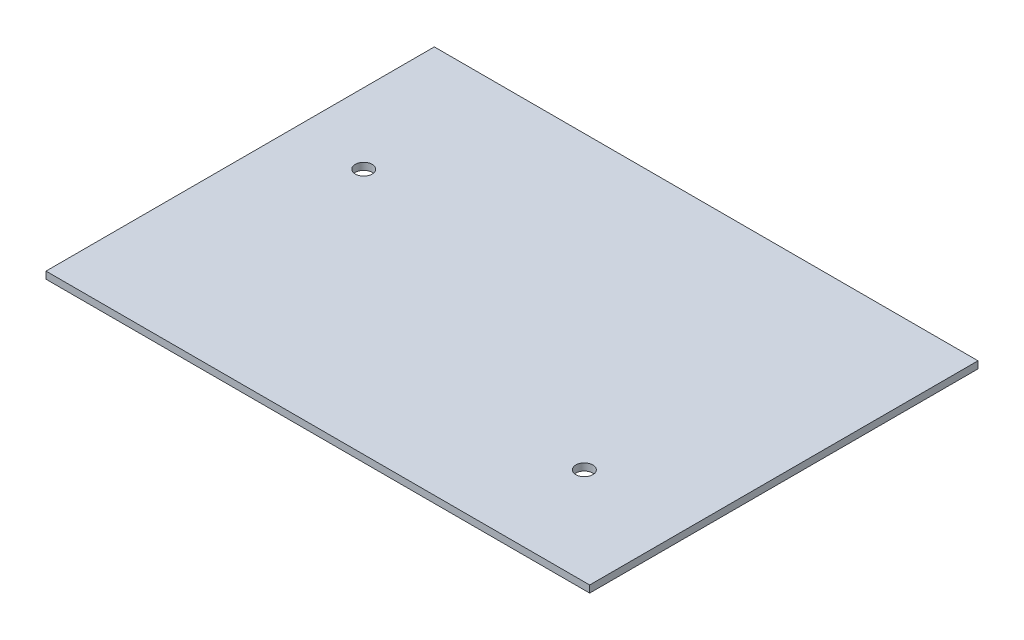
ISO-10303-21;
HEADER;
FILE_DESCRIPTION(('STEP AP214'),'2;1');
FILE_NAME('part.step','',(''),(''),'','','');
FILE_SCHEMA(('AUTOMOTIVE_DESIGN { 1 0 10303 214 1 1 1 1 }'));
ENDSEC;
DATA;
#1=APPLICATION_CONTEXT('core data for automotive mechanical design processes');
#2=APPLICATION_PROTOCOL_DEFINITION('international standard','automotive_design',2000,#1);
#3=PRODUCT_CONTEXT('',#1,'mechanical');
#4=PRODUCT('Part','Part','',(#3));
#5=PRODUCT_RELATED_PRODUCT_CATEGORY('part','',(#4));
#6=PRODUCT_DEFINITION_FORMATION('','',#4);
#7=PRODUCT_DEFINITION_CONTEXT('part definition',#1,'design');
#8=PRODUCT_DEFINITION('design','',#6,#7);
#9=PRODUCT_DEFINITION_SHAPE('','',#8);
#10=(LENGTH_UNIT() NAMED_UNIT(*) SI_UNIT(.MILLI.,.METRE.));
#11=(NAMED_UNIT(*) PLANE_ANGLE_UNIT() SI_UNIT($,.RADIAN.));
#12=(NAMED_UNIT(*) SI_UNIT($,.STERADIAN.) SOLID_ANGLE_UNIT());
#13=UNCERTAINTY_MEASURE_WITH_UNIT(LENGTH_MEASURE(1.E-05),#10,'distance_accuracy_value','');
#14=(GEOMETRIC_REPRESENTATION_CONTEXT(3) GLOBAL_UNCERTAINTY_ASSIGNED_CONTEXT((#13)) GLOBAL_UNIT_ASSIGNED_CONTEXT((#10,
#11,#12)) REPRESENTATION_CONTEXT('',''));
#15=CARTESIAN_POINT('',(0.,0.,0.));
#16=DIRECTION('',(0.,0.,1.));
#17=DIRECTION('',(1.,0.,0.));
#18=AXIS2_PLACEMENT_3D('',#15,#16,#17);
#19=CARTESIAN_POINT('',(-60.309173126615,1.27,-23.6512919896641));
#20=DIRECTION('',(1.,0.,0.));
#21=DIRECTION('',(0.,0.,-1.));
#22=AXIS2_PLACEMENT_3D('',#19,#20,#21);
#23=PLANE('',#22);
#24=DIRECTION('',(0.,0.,1.));
#25=VECTOR('',#24,1.);
#26=CARTESIAN_POINT('',(-60.309173126615,0.,-23.6512919896641));
#27=LINE('',#26,#25);
#28=CARTESIAN_POINT('',(-60.309173126615,0.,-23.6512919896641));
#29=VERTEX_POINT('',#28);
#30=CARTESIAN_POINT('',(-60.309173126615,0.,46.1987080103359));
#31=VERTEX_POINT('',#30);
#32=EDGE_CURVE('E100',#29,#31,#27,.T.);
#33=ORIENTED_EDGE('',*,*,#32,.T.);
#34=DIRECTION('',(0.,-1.,0.));
#35=VECTOR('',#34,1.);
#36=CARTESIAN_POINT('',(-60.309173126615,1.27,46.1987080103359));
#37=LINE('',#36,#35);
#38=CARTESIAN_POINT('',(-60.309173126615,1.27,46.1987080103359));
#39=VERTEX_POINT('',#38);
#40=EDGE_CURVE('E11',#39,#31,#37,.T.);
#41=ORIENTED_EDGE('',*,*,#40,.F.);
#42=DIRECTION('',(0.,0.,1.));
#43=VECTOR('',#42,1.);
#44=CARTESIAN_POINT('',(-60.309173126615,1.27,-23.6512919896641));
#45=LINE('',#44,#43);
#46=CARTESIAN_POINT('',(-60.309173126615,1.27,-23.6512919896641));
#47=VERTEX_POINT('',#46);
#48=EDGE_CURVE('E87',#47,#39,#45,.T.);
#49=ORIENTED_EDGE('',*,*,#48,.F.);
#50=DIRECTION('',(0.,-1.,0.));
#51=VECTOR('',#50,1.);
#52=CARTESIAN_POINT('',(-60.309173126615,1.27,-23.6512919896641));
#53=LINE('',#52,#51);
#54=EDGE_CURVE('E96',#47,#29,#53,.T.);
#55=ORIENTED_EDGE('',*,*,#54,.T.);
#56=EDGE_LOOP('',(#33,#41,#49,#55));
#57=FACE_BOUND('',#56,.T.);
#58=ADVANCED_FACE('F34',(#57),#23,.F.);
#59=CARTESIAN_POINT('',(-60.309173126615,1.27,46.1987080103359));
#60=DIRECTION('',(0.,0.,-1.));
#61=DIRECTION('',(-1.,0.,0.));
#62=AXIS2_PLACEMENT_3D('',#59,#60,#61);
#63=PLANE('',#62);
#64=DIRECTION('',(1.,0.,0.));
#65=VECTOR('',#64,1.);
#66=CARTESIAN_POINT('',(-60.309173126615,0.,46.1987080103359));
#67=LINE('',#66,#65);
#68=CARTESIAN_POINT('',(37.480826873385,0.,46.1987080103359));
#69=VERTEX_POINT('',#68);
#70=EDGE_CURVE('E91',#31,#69,#67,.T.);
#71=ORIENTED_EDGE('',*,*,#70,.T.);
#72=DIRECTION('',(0.,-1.,0.));
#73=VECTOR('',#72,1.);
#74=CARTESIAN_POINT('',(37.480826873385,1.27,46.1987080103359));
#75=LINE('',#74,#73);
#76=CARTESIAN_POINT('',(37.480826873385,1.27,46.1987080103359));
#77=VERTEX_POINT('',#76);
#78=EDGE_CURVE('E43',#77,#69,#75,.T.);
#79=ORIENTED_EDGE('',*,*,#78,.F.);
#80=DIRECTION('',(1.,0.,0.));
#81=VECTOR('',#80,1.);
#82=CARTESIAN_POINT('',(-60.309173126615,1.27,46.1987080103359));
#83=LINE('',#82,#81);
#84=EDGE_CURVE('E82',#39,#77,#83,.T.);
#85=ORIENTED_EDGE('',*,*,#84,.F.);
#86=ORIENTED_EDGE('',*,*,#40,.T.);
#87=EDGE_LOOP('',(#71,#79,#85,#86));
#88=FACE_BOUND('',#87,.T.);
#89=ADVANCED_FACE('F90',(#88),#63,.F.);
#90=CARTESIAN_POINT('',(37.480826873385,1.27,-23.6512919896641));
#91=DIRECTION('',(-1.,0.,0.));
#92=DIRECTION('',(0.,0.,1.));
#93=AXIS2_PLACEMENT_3D('',#90,#91,#92);
#94=PLANE('',#93);
#95=DIRECTION('',(0.,0.,-1.));
#96=VECTOR('',#95,1.);
#97=CARTESIAN_POINT('',(37.480826873385,0.,-23.6512919896641));
#98=LINE('',#97,#96);
#99=CARTESIAN_POINT('',(37.480826873385,0.,-23.6512919896641));
#100=VERTEX_POINT('',#99);
#101=EDGE_CURVE('E69',#69,#100,#98,.T.);
#102=ORIENTED_EDGE('',*,*,#101,.T.);
#103=DIRECTION('',(0.,-1.,0.));
#104=VECTOR('',#103,1.);
#105=CARTESIAN_POINT('',(37.480826873385,1.27,-23.6512919896641));
#106=LINE('',#105,#104);
#107=CARTESIAN_POINT('',(37.480826873385,1.27,-23.6512919896641));
#108=VERTEX_POINT('',#107);
#109=EDGE_CURVE('E92',#108,#100,#106,.T.);
#110=ORIENTED_EDGE('',*,*,#109,.F.);
#111=DIRECTION('',(0.,0.,-1.));
#112=VECTOR('',#111,1.);
#113=CARTESIAN_POINT('',(37.480826873385,1.27,-23.6512919896641));
#114=LINE('',#113,#112);
#115=EDGE_CURVE('E85',#77,#108,#114,.T.);
#116=ORIENTED_EDGE('',*,*,#115,.F.);
#117=ORIENTED_EDGE('',*,*,#78,.T.);
#118=EDGE_LOOP('',(#102,#110,#116,#117));
#119=FACE_BOUND('',#118,.T.);
#120=ADVANCED_FACE('F94',(#119),#94,.F.);
#121=CARTESIAN_POINT('',(-60.309173126615,1.27,-23.6512919896641));
#122=DIRECTION('',(0.,0.,1.));
#123=DIRECTION('',(1.,0.,0.));
#124=AXIS2_PLACEMENT_3D('',#121,#122,#123);
#125=PLANE('',#124);
#126=DIRECTION('',(-1.,0.,0.));
#127=VECTOR('',#126,1.);
#128=CARTESIAN_POINT('',(-60.309173126615,0.,-23.6512919896641));
#129=LINE('',#128,#127);
#130=EDGE_CURVE('E75',#100,#29,#129,.T.);
#131=ORIENTED_EDGE('',*,*,#130,.T.);
#132=ORIENTED_EDGE('',*,*,#54,.F.);
#133=DIRECTION('',(-1.,0.,0.));
#134=VECTOR('',#133,1.);
#135=CARTESIAN_POINT('',(-60.309173126615,1.27,-23.6512919896641));
#136=LINE('',#135,#134);
#137=EDGE_CURVE('E52',#108,#47,#136,.T.);
#138=ORIENTED_EDGE('',*,*,#137,.F.);
#139=ORIENTED_EDGE('',*,*,#109,.T.);
#140=EDGE_LOOP('',(#131,#132,#138,#139));
#141=FACE_BOUND('',#140,.T.);
#142=ADVANCED_FACE('F128',(#141),#125,.F.);
#143=CARTESIAN_POINT('',(-60.309173126615,1.27,46.1987080103359));
#144=DIRECTION('',(0.,1.,0.));
#145=DIRECTION('',(0.,0.,1.));
#146=AXIS2_PLACEMENT_3D('',#143,#144,#145);
#147=PLANE('',#146);
#148=CARTESIAN_POINT('',(19.065826873385,1.27,28.7362080103359));
#149=DIRECTION('',(0.,1.,0.));
#150=DIRECTION('',(0.,0.,1.));
#151=AXIS2_PLACEMENT_3D('',#148,#149,#150);
#152=CIRCLE('',#151,1.524);
#153=CARTESIAN_POINT('',(19.065826873385,1.27,30.2602080103359));
#154=VERTEX_POINT('',#153);
#155=EDGE_CURVE('E117',#154,#154,#152,.T.);
#156=ORIENTED_EDGE('',*,*,#155,.F.);
#157=EDGE_LOOP('',(#156));
#158=FACE_BOUND('',#157,.T.);
#159=CARTESIAN_POINT('',(-47.609173126615,1.27,1.74870801033594));
#160=DIRECTION('',(0.,1.,0.));
#161=DIRECTION('',(0.,0.,1.));
#162=AXIS2_PLACEMENT_3D('',#159,#160,#161);
#163=CIRCLE('',#162,1.524);
#164=CARTESIAN_POINT('',(-47.609173126615,1.27,3.27270801033593));
#165=VERTEX_POINT('',#164);
#166=EDGE_CURVE('E109',#165,#165,#163,.T.);
#167=ORIENTED_EDGE('',*,*,#166,.F.);
#168=EDGE_LOOP('',(#167));
#169=FACE_BOUND('',#168,.T.);
#170=ORIENTED_EDGE('',*,*,#48,.T.);
#171=ORIENTED_EDGE('',*,*,#84,.T.);
#172=ORIENTED_EDGE('',*,*,#115,.T.);
#173=ORIENTED_EDGE('',*,*,#137,.T.);
#174=EDGE_LOOP('',(#170,#171,#172,#173));
#175=FACE_BOUND('',#174,.T.);
#176=ADVANCED_FACE('F83',(#158,#169,#175),#147,.T.);
#177=CARTESIAN_POINT('',(-60.309173126615,0.,46.1987080103359));
#178=DIRECTION('',(0.,1.,0.));
#179=DIRECTION('',(0.,0.,1.));
#180=AXIS2_PLACEMENT_3D('',#177,#178,#179);
#181=PLANE('',#180);
#182=CARTESIAN_POINT('',(19.065826873385,0.,28.7362080103359));
#183=DIRECTION('',(0.,1.,0.));
#184=DIRECTION('',(0.,0.,1.));
#185=AXIS2_PLACEMENT_3D('',#182,#183,#184);
#186=CIRCLE('',#185,1.524);
#187=CARTESIAN_POINT('',(19.065826873385,0.,30.2602080103359));
#188=VERTEX_POINT('',#187);
#189=EDGE_CURVE('E37',#188,#188,#186,.T.);
#190=ORIENTED_EDGE('',*,*,#189,.T.);
#191=EDGE_LOOP('',(#190));
#192=FACE_BOUND('',#191,.T.);
#193=CARTESIAN_POINT('',(-47.609173126615,0.,1.74870801033594));
#194=DIRECTION('',(0.,1.,0.));
#195=DIRECTION('',(0.,0.,1.));
#196=AXIS2_PLACEMENT_3D('',#193,#194,#195);
#197=CIRCLE('',#196,1.52399999999999);
#198=CARTESIAN_POINT('',(-47.609173126615,0.,3.27270801033593));
#199=VERTEX_POINT('',#198);
#200=EDGE_CURVE('E103',#199,#199,#197,.T.);
#201=ORIENTED_EDGE('',*,*,#200,.T.);
#202=EDGE_LOOP('',(#201));
#203=FACE_BOUND('',#202,.T.);
#204=ORIENTED_EDGE('',*,*,#32,.F.);
#205=ORIENTED_EDGE('',*,*,#130,.F.);
#206=ORIENTED_EDGE('',*,*,#101,.F.);
#207=ORIENTED_EDGE('',*,*,#70,.F.);
#208=EDGE_LOOP('',(#204,#205,#206,#207));
#209=FACE_BOUND('',#208,.T.);
#210=ADVANCED_FACE('F127',(#192,#203,#209),#181,.F.);
#211=CARTESIAN_POINT('',(-47.609173126615,1.27,1.74870801033594));
#212=DIRECTION('',(0.,1.,0.));
#213=DIRECTION('',(0.,0.,1.));
#214=AXIS2_PLACEMENT_3D('',#211,#212,#213);
#215=CYLINDRICAL_SURFACE('',#214,1.52399999999999);
#216=ORIENTED_EDGE('',*,*,#166,.T.);
#217=EDGE_LOOP('',(#216));
#218=FACE_BOUND('',#217,.T.);
#219=ORIENTED_EDGE('',*,*,#200,.F.);
#220=EDGE_LOOP('',(#219));
#221=FACE_BOUND('',#220,.T.);
#222=ADVANCED_FACE('F134',(#218,#221),#215,.F.);
#223=CARTESIAN_POINT('',(19.065826873385,1.27,28.7362080103359));
#224=DIRECTION('',(0.,1.,0.));
#225=DIRECTION('',(0.,0.,1.));
#226=AXIS2_PLACEMENT_3D('',#223,#224,#225);
#227=CYLINDRICAL_SURFACE('',#226,1.524);
#228=ORIENTED_EDGE('',*,*,#155,.T.);
#229=EDGE_LOOP('',(#228));
#230=FACE_BOUND('',#229,.T.);
#231=ORIENTED_EDGE('',*,*,#189,.F.);
#232=EDGE_LOOP('',(#231));
#233=FACE_BOUND('',#232,.T.);
#234=ADVANCED_FACE('F122',(#230,#233),#227,.F.);
#235=CLOSED_SHELL('',(#58,#89,#120,#142,#176,#210,#222,#234));
#236=MANIFOLD_SOLID_BREP('B2',#235);
#237=ADVANCED_BREP_SHAPE_REPRESENTATION('',(#18,#236),#14);
#238=SHAPE_DEFINITION_REPRESENTATION(#9,#237);
ENDSEC;
END-ISO-10303-21;
